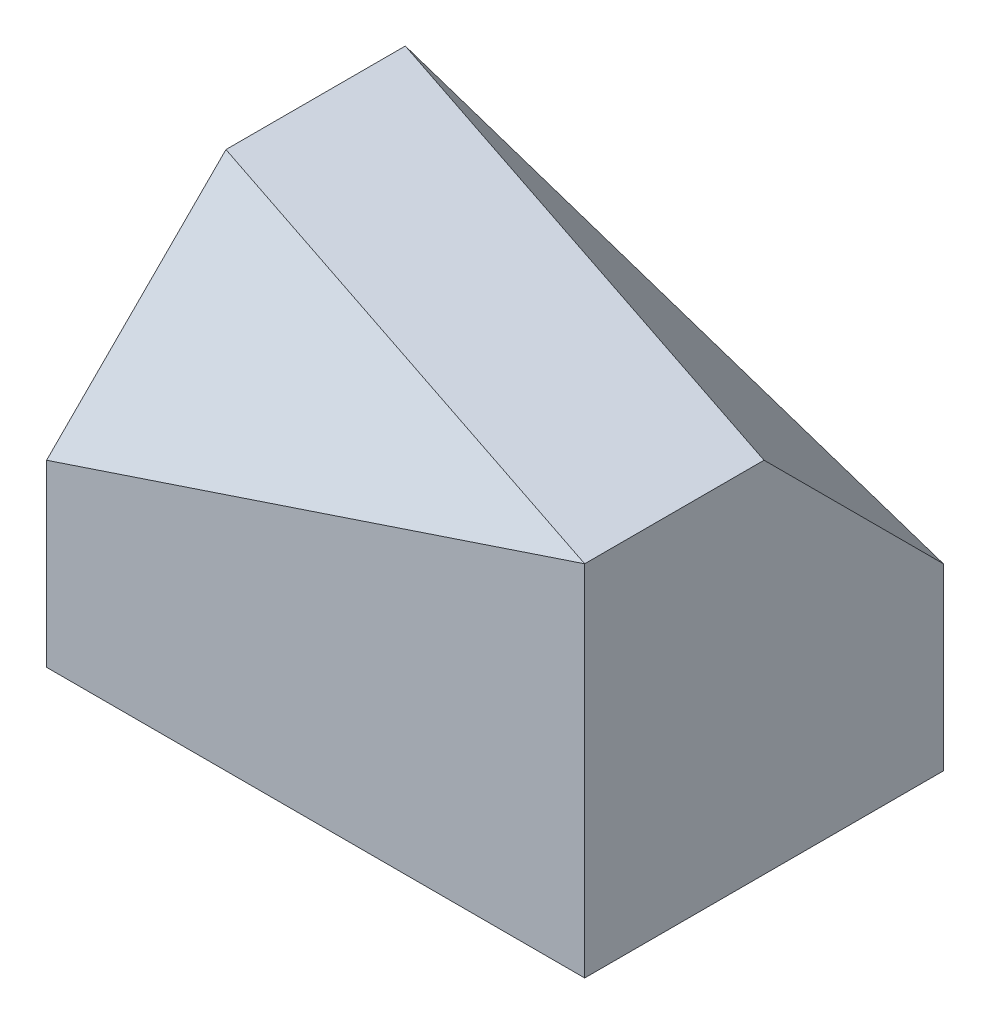
ISO-10303-21;
HEADER;
FILE_DESCRIPTION(('STEP AP214'),'2;1');
FILE_NAME('part.step','',(''),(''),'','','');
FILE_SCHEMA(('AUTOMOTIVE_DESIGN { 1 0 10303 214 1 1 1 1 }'));
ENDSEC;
DATA;
#1=APPLICATION_CONTEXT('core data for automotive mechanical design processes');
#2=APPLICATION_PROTOCOL_DEFINITION('international standard','automotive_design',2000,#1);
#3=PRODUCT_CONTEXT('',#1,'mechanical');
#4=PRODUCT('Part','Part','',(#3));
#5=PRODUCT_RELATED_PRODUCT_CATEGORY('part','',(#4));
#6=PRODUCT_DEFINITION_FORMATION('','',#4);
#7=PRODUCT_DEFINITION_CONTEXT('part definition',#1,'design');
#8=PRODUCT_DEFINITION('design','',#6,#7);
#9=PRODUCT_DEFINITION_SHAPE('','',#8);
#10=(LENGTH_UNIT() NAMED_UNIT(*) SI_UNIT(.MILLI.,.METRE.));
#11=(NAMED_UNIT(*) PLANE_ANGLE_UNIT() SI_UNIT($,.RADIAN.));
#12=(NAMED_UNIT(*) SI_UNIT($,.STERADIAN.) SOLID_ANGLE_UNIT());
#13=UNCERTAINTY_MEASURE_WITH_UNIT(LENGTH_MEASURE(1.E-05),#10,'distance_accuracy_value','');
#14=(GEOMETRIC_REPRESENTATION_CONTEXT(3) GLOBAL_UNCERTAINTY_ASSIGNED_CONTEXT((#13)) GLOBAL_UNIT_ASSIGNED_CONTEXT((#10,
#11,#12)) REPRESENTATION_CONTEXT('',''));
#15=CARTESIAN_POINT('',(0.,0.,0.));
#16=DIRECTION('',(0.,0.,1.));
#17=DIRECTION('',(1.,0.,0.));
#18=AXIS2_PLACEMENT_3D('',#15,#16,#17);
#19=CARTESIAN_POINT('',(0.,1016.,0.));
#20=DIRECTION('',(0.,1.,0.));
#21=DIRECTION('',(0.,0.,1.));
#22=AXIS2_PLACEMENT_3D('',#19,#20,#21);
#23=PLANE('',#22);
#24=DIRECTION('',(0.,0.,-1.));
#25=VECTOR('',#24,1.);
#26=CARTESIAN_POINT('',(0.,1016.,0.));
#27=LINE('',#26,#25);
#28=CARTESIAN_POINT('',(0.,1016.,-507.999999999999));
#29=VERTEX_POINT('',#28);
#30=CARTESIAN_POINT('',(0.,1016.,-1016.));
#31=VERTEX_POINT('',#30);
#32=EDGE_CURVE('E57',#29,#31,#27,.T.);
#33=ORIENTED_EDGE('',*,*,#32,.F.);
#34=DIRECTION('',(0.948683298050514,0.,0.316227766016838));
#35=VECTOR('',#34,1.);
#36=CARTESIAN_POINT('',(152.4,1016.,-457.2));
#37=LINE('',#36,#35);
#38=CARTESIAN_POINT('',(1524.,1016.,0.));
#39=VERTEX_POINT('',#38);
#40=EDGE_CURVE('E126',#29,#39,#37,.T.);
#41=ORIENTED_EDGE('',*,*,#40,.T.);
#42=DIRECTION('',(0.,0.,1.));
#43=VECTOR('',#42,1.);
#44=CARTESIAN_POINT('',(1524.,1016.,-3.33066907387547E-13));
#45=LINE('',#44,#43);
#46=CARTESIAN_POINT('',(1524.,1016.,-508.));
#47=VERTEX_POINT('',#46);
#48=EDGE_CURVE('E102',#47,#39,#45,.T.);
#49=ORIENTED_EDGE('',*,*,#48,.F.);
#50=DIRECTION('',(-0.948683298050514,0.,-0.316227766016838));
#51=VECTOR('',#50,1.);
#52=CARTESIAN_POINT('',(304.8,1016.,-914.4));
#53=LINE('',#52,#51);
#54=EDGE_CURVE('E43',#47,#31,#53,.T.);
#55=ORIENTED_EDGE('',*,*,#54,.T.);
#56=EDGE_LOOP('',(#33,#41,#49,#55));
#57=FACE_BOUND('',#56,.T.);
#58=ADVANCED_FACE('F35',(#57),#23,.T.);
#59=CARTESIAN_POINT('',(0.,1016.,0.));
#60=DIRECTION('',(-1.,0.,0.));
#61=DIRECTION('',(0.,0.,1.));
#62=AXIS2_PLACEMENT_3D('',#59,#60,#61);
#63=PLANE('',#62);
#64=DIRECTION('',(0.,-1.,0.));
#65=VECTOR('',#64,1.);
#66=CARTESIAN_POINT('',(0.,1016.,0.));
#67=LINE('',#66,#65);
#68=CARTESIAN_POINT('',(0.,508.,0.));
#69=VERTEX_POINT('',#68);
#70=CARTESIAN_POINT('',(0.,0.,0.));
#71=VERTEX_POINT('',#70);
#72=EDGE_CURVE('E108',#69,#71,#67,.T.);
#73=ORIENTED_EDGE('',*,*,#72,.F.);
#74=DIRECTION('',(0.,0.707106781186548,-0.707106781186547));
#75=VECTOR('',#74,1.);
#76=CARTESIAN_POINT('',(0.,762.,-254.));
#77=LINE('',#76,#75);
#78=EDGE_CURVE('E50',#69,#29,#77,.T.);
#79=ORIENTED_EDGE('',*,*,#78,.T.);
#80=ORIENTED_EDGE('',*,*,#32,.T.);
#81=DIRECTION('',(0.,-1.,0.));
#82=VECTOR('',#81,1.);
#83=CARTESIAN_POINT('',(0.,1016.,-1016.));
#84=LINE('',#83,#82);
#85=CARTESIAN_POINT('',(0.,0.,-1016.));
#86=VERTEX_POINT('',#85);
#87=EDGE_CURVE('E85',#31,#86,#84,.T.);
#88=ORIENTED_EDGE('',*,*,#87,.T.);
#89=DIRECTION('',(0.,0.,-1.));
#90=VECTOR('',#89,1.);
#91=CARTESIAN_POINT('',(0.,0.,0.));
#92=LINE('',#91,#90);
#93=EDGE_CURVE('E100',#71,#86,#92,.T.);
#94=ORIENTED_EDGE('',*,*,#93,.F.);
#95=EDGE_LOOP('',(#73,#79,#80,#88,#94));
#96=FACE_BOUND('',#95,.T.);
#97=ADVANCED_FACE('F37',(#96),#63,.T.);
#98=CARTESIAN_POINT('',(0.,1016.,0.));
#99=DIRECTION('',(0.,0.,1.));
#100=DIRECTION('',(1.,0.,0.));
#101=AXIS2_PLACEMENT_3D('',#98,#99,#100);
#102=PLANE('',#101);
#103=DIRECTION('',(0.,-1.,0.));
#104=VECTOR('',#103,1.);
#105=CARTESIAN_POINT('',(1524.,1016.,0.));
#106=LINE('',#105,#104);
#107=CARTESIAN_POINT('',(1524.,0.,0.));
#108=VERTEX_POINT('',#107);
#109=EDGE_CURVE('E84',#39,#108,#106,.T.);
#110=ORIENTED_EDGE('',*,*,#109,.F.);
#111=DIRECTION('',(-0.948683298050514,-0.316227766016838,0.));
#112=VECTOR('',#111,1.);
#113=CARTESIAN_POINT('',(152.4,558.8,0.));
#114=LINE('',#113,#112);
#115=EDGE_CURVE('E12',#39,#69,#114,.T.);
#116=ORIENTED_EDGE('',*,*,#115,.T.);
#117=ORIENTED_EDGE('',*,*,#72,.T.);
#118=DIRECTION('',(-1.,0.,0.));
#119=VECTOR('',#118,1.);
#120=CARTESIAN_POINT('',(0.,0.,0.));
#121=LINE('',#120,#119);
#122=EDGE_CURVE('E95',#108,#71,#121,.T.);
#123=ORIENTED_EDGE('',*,*,#122,.F.);
#124=EDGE_LOOP('',(#110,#116,#117,#123));
#125=FACE_BOUND('',#124,.T.);
#126=ADVANCED_FACE('F132',(#125),#102,.T.);
#127=CARTESIAN_POINT('',(1524.,1016.,-3.33066907387547E-13));
#128=DIRECTION('',(1.,0.,0.));
#129=DIRECTION('',(0.,0.,-1.));
#130=AXIS2_PLACEMENT_3D('',#127,#128,#129);
#131=PLANE('',#130);
#132=DIRECTION('',(0.,-1.,0.));
#133=VECTOR('',#132,1.);
#134=CARTESIAN_POINT('',(1524.,1016.,-1016.));
#135=LINE('',#134,#133);
#136=CARTESIAN_POINT('',(1524.,507.999999999999,-1016.));
#137=VERTEX_POINT('',#136);
#138=CARTESIAN_POINT('',(1524.,0.,-1016.));
#139=VERTEX_POINT('',#138);
#140=EDGE_CURVE('E75',#137,#139,#135,.T.);
#141=ORIENTED_EDGE('',*,*,#140,.F.);
#142=DIRECTION('',(0.,0.707106781186548,0.707106781186547));
#143=VECTOR('',#142,1.);
#144=CARTESIAN_POINT('',(1524.,1270.,-254.));
#145=LINE('',#144,#143);
#146=EDGE_CURVE('E119',#137,#47,#145,.T.);
#147=ORIENTED_EDGE('',*,*,#146,.T.);
#148=ORIENTED_EDGE('',*,*,#48,.T.);
#149=ORIENTED_EDGE('',*,*,#109,.T.);
#150=DIRECTION('',(0.,0.,1.));
#151=VECTOR('',#150,1.);
#152=CARTESIAN_POINT('',(1524.,0.,-3.33066907387547E-13));
#153=LINE('',#152,#151);
#154=EDGE_CURVE('E88',#139,#108,#153,.T.);
#155=ORIENTED_EDGE('',*,*,#154,.F.);
#156=EDGE_LOOP('',(#141,#147,#148,#149,#155));
#157=FACE_BOUND('',#156,.T.);
#158=ADVANCED_FACE('F89',(#157),#131,.T.);
#159=CARTESIAN_POINT('',(0.,1016.,-1016.));
#160=DIRECTION('',(0.,0.,-1.));
#161=DIRECTION('',(-1.,0.,0.));
#162=AXIS2_PLACEMENT_3D('',#159,#160,#161);
#163=PLANE('',#162);
#164=ORIENTED_EDGE('',*,*,#87,.F.);
#165=DIRECTION('',(0.948683298050514,-0.316227766016838,0.));
#166=VECTOR('',#165,1.);
#167=CARTESIAN_POINT('',(-1.63328061458243E-13,1016.,-1016.));
#168=LINE('',#167,#166);
#169=EDGE_CURVE('E81',#31,#137,#168,.T.);
#170=ORIENTED_EDGE('',*,*,#169,.T.);
#171=ORIENTED_EDGE('',*,*,#140,.T.);
#172=DIRECTION('',(1.,0.,0.));
#173=VECTOR('',#172,1.);
#174=CARTESIAN_POINT('',(0.,0.,-1016.));
#175=LINE('',#174,#173);
#176=EDGE_CURVE('E80',#86,#139,#175,.T.);
#177=ORIENTED_EDGE('',*,*,#176,.F.);
#178=EDGE_LOOP('',(#164,#170,#171,#177));
#179=FACE_BOUND('',#178,.T.);
#180=ADVANCED_FACE('F78',(#179),#163,.T.);
#181=CARTESIAN_POINT('',(0.,0.,0.));
#182=DIRECTION('',(0.,1.,0.));
#183=DIRECTION('',(0.,0.,1.));
#184=AXIS2_PLACEMENT_3D('',#181,#182,#183);
#185=PLANE('',#184);
#186=ORIENTED_EDGE('',*,*,#93,.T.);
#187=ORIENTED_EDGE('',*,*,#176,.T.);
#188=ORIENTED_EDGE('',*,*,#154,.T.);
#189=ORIENTED_EDGE('',*,*,#122,.T.);
#190=EDGE_LOOP('',(#186,#187,#188,#189));
#191=FACE_BOUND('',#190,.T.);
#192=ADVANCED_FACE('F98',(#191),#185,.F.);
#193=CARTESIAN_POINT('',(320.842105263158,962.526315789473,-962.526315789474));
#194=DIRECTION('',(0.229415733870562,0.688247201611685,-0.688247201611686));
#195=DIRECTION('',(0.,0.707106781186548,0.707106781186547));
#196=AXIS2_PLACEMENT_3D('',#193,#194,#195);
#197=PLANE('',#196);
#198=ORIENTED_EDGE('',*,*,#146,.F.);
#199=ORIENTED_EDGE('',*,*,#169,.F.);
#200=ORIENTED_EDGE('',*,*,#54,.F.);
#201=EDGE_LOOP('',(#198,#199,#200));
#202=FACE_BOUND('',#201,.T.);
#203=ADVANCED_FACE('F145',(#202),#197,.T.);
#204=CARTESIAN_POINT('',(-80.2105263157895,240.631578947368,240.631578947368));
#205=DIRECTION('',(-0.229415733870562,0.688247201611685,0.688247201611685));
#206=DIRECTION('',(0.,-0.707106781186548,0.707106781186547));
#207=AXIS2_PLACEMENT_3D('',#204,#205,#206);
#208=PLANE('',#207);
#209=ORIENTED_EDGE('',*,*,#40,.F.);
#210=ORIENTED_EDGE('',*,*,#78,.F.);
#211=ORIENTED_EDGE('',*,*,#115,.F.);
#212=EDGE_LOOP('',(#209,#210,#211));
#213=FACE_BOUND('',#212,.T.);
#214=ADVANCED_FACE('F131',(#213),#208,.T.);
#215=CLOSED_SHELL('',(#58,#97,#126,#158,#180,#192,#203,#214));
#216=MANIFOLD_SOLID_BREP('B2',#215);
#217=ADVANCED_BREP_SHAPE_REPRESENTATION('',(#18,#216),#14);
#218=SHAPE_DEFINITION_REPRESENTATION(#9,#217);
ENDSEC;
END-ISO-10303-21;
